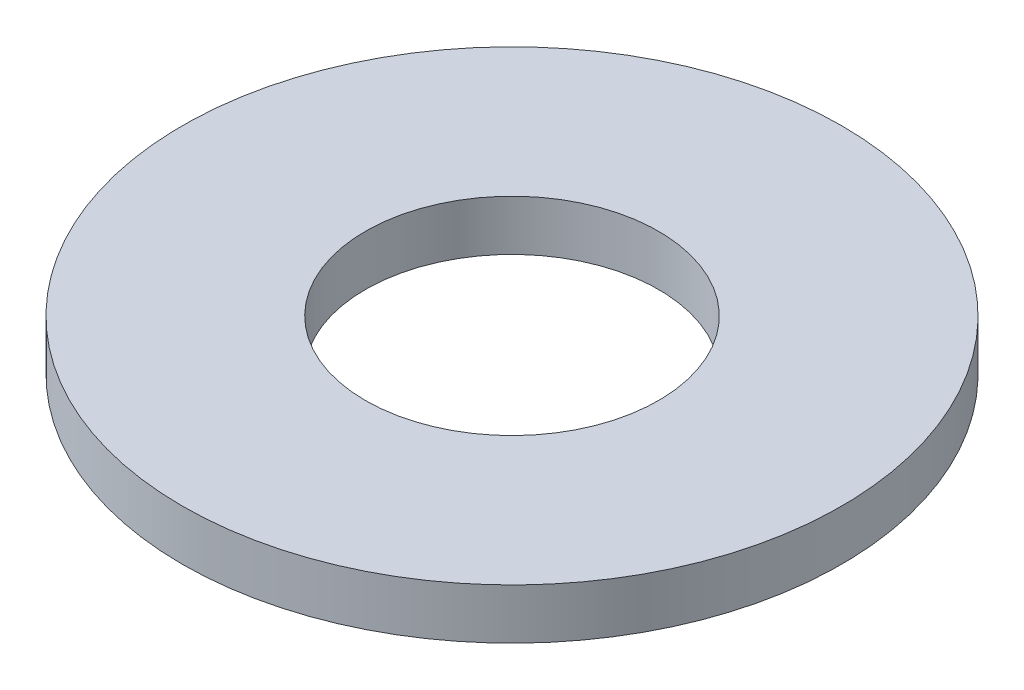
ISO-10303-21;
HEADER;
FILE_DESCRIPTION(('STEP AP214'),'2;1');
FILE_NAME('part.step','',(''),(''),'','','');
FILE_SCHEMA(('AUTOMOTIVE_DESIGN { 1 0 10303 214 1 1 1 1 }'));
ENDSEC;
DATA;
#1=APPLICATION_CONTEXT('core data for automotive mechanical design processes');
#2=APPLICATION_PROTOCOL_DEFINITION('international standard','automotive_design',2000,#1);
#3=PRODUCT_CONTEXT('',#1,'mechanical');
#4=PRODUCT('Part','Part','',(#3));
#5=PRODUCT_RELATED_PRODUCT_CATEGORY('part','',(#4));
#6=PRODUCT_DEFINITION_FORMATION('','',#4);
#7=PRODUCT_DEFINITION_CONTEXT('part definition',#1,'design');
#8=PRODUCT_DEFINITION('design','',#6,#7);
#9=PRODUCT_DEFINITION_SHAPE('','',#8);
#10=(LENGTH_UNIT() NAMED_UNIT(*) SI_UNIT(.MILLI.,.METRE.));
#11=(NAMED_UNIT(*) PLANE_ANGLE_UNIT() SI_UNIT($,.RADIAN.));
#12=(NAMED_UNIT(*) SI_UNIT($,.STERADIAN.) SOLID_ANGLE_UNIT());
#13=UNCERTAINTY_MEASURE_WITH_UNIT(LENGTH_MEASURE(1.E-05),#10,'distance_accuracy_value','');
#14=(GEOMETRIC_REPRESENTATION_CONTEXT(3) GLOBAL_UNCERTAINTY_ASSIGNED_CONTEXT((#13)) GLOBAL_UNIT_ASSIGNED_CONTEXT((#10,
#11,#12)) REPRESENTATION_CONTEXT('',''));
#15=CARTESIAN_POINT('',(0.,0.,0.));
#16=DIRECTION('',(0.,0.,1.));
#17=DIRECTION('',(1.,0.,0.));
#18=AXIS2_PLACEMENT_3D('',#15,#16,#17);
#19=CARTESIAN_POINT('',(0.,1.0922,0.));
#20=DIRECTION('',(0.,-1.,0.));
#21=DIRECTION('',(0.,0.,-1.));
#22=AXIS2_PLACEMENT_3D('',#19,#20,#21);
#23=CYLINDRICAL_SURFACE('',#22,7.1374);
#24=CARTESIAN_POINT('',(0.,1.0922,0.));
#25=DIRECTION('',(0.,1.,0.));
#26=DIRECTION('',(0.,0.,1.));
#27=AXIS2_PLACEMENT_3D('',#24,#25,#26);
#28=CIRCLE('',#27,7.1374);
#29=CARTESIAN_POINT('',(0.,1.0922,7.1374));
#30=VERTEX_POINT('',#29);
#31=EDGE_CURVE('E10',#30,#30,#28,.T.);
#32=ORIENTED_EDGE('',*,*,#31,.F.);
#33=EDGE_LOOP('',(#32));
#34=FACE_BOUND('',#33,.T.);
#35=CARTESIAN_POINT('',(0.,0.,0.));
#36=DIRECTION('',(0.,1.,0.));
#37=DIRECTION('',(0.,0.,1.));
#38=AXIS2_PLACEMENT_3D('',#35,#36,#37);
#39=CIRCLE('',#38,7.1374);
#40=CARTESIAN_POINT('',(0.,0.,7.1374));
#41=VERTEX_POINT('',#40);
#42=EDGE_CURVE('E33',#41,#41,#39,.T.);
#43=ORIENTED_EDGE('',*,*,#42,.T.);
#44=EDGE_LOOP('',(#43));
#45=FACE_BOUND('',#44,.T.);
#46=ADVANCED_FACE('F30',(#34,#45),#23,.T.);
#47=CARTESIAN_POINT('',(0.,1.0922,0.));
#48=DIRECTION('',(0.,1.,0.));
#49=DIRECTION('',(0.,0.,1.));
#50=AXIS2_PLACEMENT_3D('',#47,#48,#49);
#51=PLANE('',#50);
#52=CARTESIAN_POINT('',(0.,1.0922,0.));
#53=DIRECTION('',(0.,1.,0.));
#54=DIRECTION('',(0.,0.,1.));
#55=AXIS2_PLACEMENT_3D('',#52,#53,#54);
#56=CIRCLE('',#55,3.175);
#57=CARTESIAN_POINT('',(0.,1.0922,3.175));
#58=VERTEX_POINT('',#57);
#59=EDGE_CURVE('E42',#58,#58,#56,.T.);
#60=ORIENTED_EDGE('',*,*,#59,.F.);
#61=EDGE_LOOP('',(#60));
#62=FACE_BOUND('',#61,.T.);
#63=ORIENTED_EDGE('',*,*,#31,.T.);
#64=EDGE_LOOP('',(#63));
#65=FACE_BOUND('',#64,.T.);
#66=ADVANCED_FACE('F57',(#62,#65),#51,.T.);
#67=CARTESIAN_POINT('',(0.,0.,0.));
#68=DIRECTION('',(0.,1.,0.));
#69=DIRECTION('',(0.,0.,1.));
#70=AXIS2_PLACEMENT_3D('',#67,#68,#69);
#71=PLANE('',#70);
#72=CARTESIAN_POINT('',(0.,0.,0.));
#73=DIRECTION('',(0.,1.,0.));
#74=DIRECTION('',(0.,0.,1.));
#75=AXIS2_PLACEMENT_3D('',#72,#73,#74);
#76=CIRCLE('',#75,3.175);
#77=CARTESIAN_POINT('',(0.,0.,3.175));
#78=VERTEX_POINT('',#77);
#79=EDGE_CURVE('E40',#78,#78,#76,.T.);
#80=ORIENTED_EDGE('',*,*,#79,.T.);
#81=EDGE_LOOP('',(#80));
#82=FACE_BOUND('',#81,.T.);
#83=ORIENTED_EDGE('',*,*,#42,.F.);
#84=EDGE_LOOP('',(#83));
#85=FACE_BOUND('',#84,.T.);
#86=ADVANCED_FACE('F48',(#82,#85),#71,.F.);
#87=CARTESIAN_POINT('',(0.,0.,0.));
#88=DIRECTION('',(0.,1.,0.));
#89=DIRECTION('',(0.,0.,1.));
#90=AXIS2_PLACEMENT_3D('',#87,#88,#89);
#91=CYLINDRICAL_SURFACE('',#90,3.175);
#92=ORIENTED_EDGE('',*,*,#79,.F.);
#93=EDGE_LOOP('',(#92));
#94=FACE_BOUND('',#93,.T.);
#95=ORIENTED_EDGE('',*,*,#59,.T.);
#96=EDGE_LOOP('',(#95));
#97=FACE_BOUND('',#96,.T.);
#98=ADVANCED_FACE('F51',(#94,#97),#91,.F.);
#99=CLOSED_SHELL('',(#46,#66,#86,#98));
#100=MANIFOLD_SOLID_BREP('B2',#99);
#101=ADVANCED_BREP_SHAPE_REPRESENTATION('',(#18,#100),#14);
#102=SHAPE_DEFINITION_REPRESENTATION(#9,#101);
ENDSEC;
END-ISO-10303-21;
